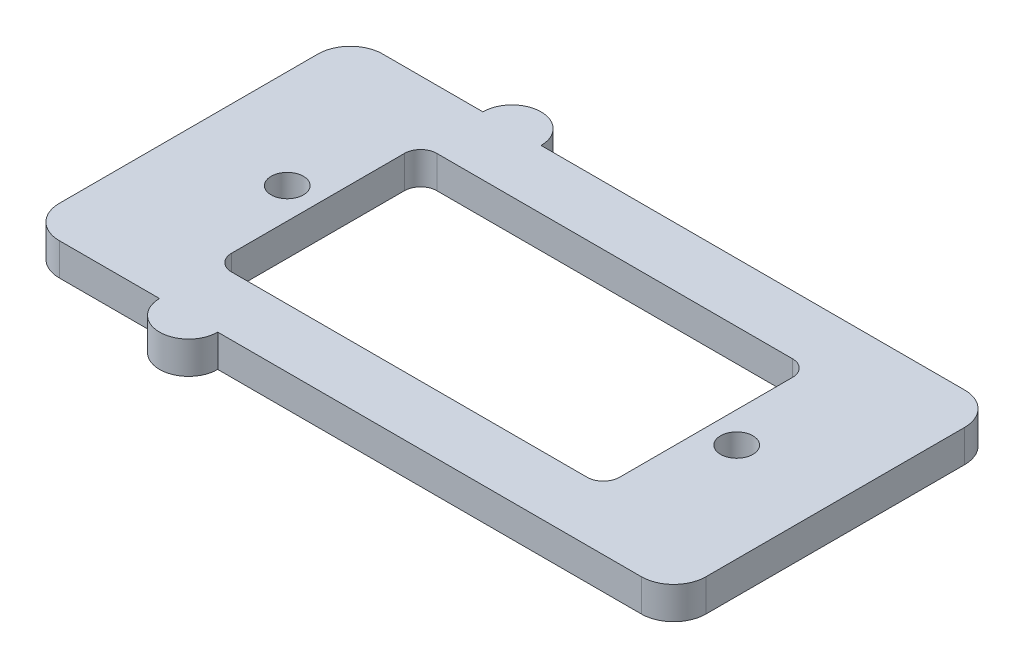
ISO-10303-21;
HEADER;
FILE_DESCRIPTION(('STEP AP214'),'2;1');
FILE_NAME('part.step','',(''),(''),'','','');
FILE_SCHEMA(('AUTOMOTIVE_DESIGN { 1 0 10303 214 1 1 1 1 }'));
ENDSEC;
DATA;
#1=APPLICATION_CONTEXT('core data for automotive mechanical design processes');
#2=APPLICATION_PROTOCOL_DEFINITION('international standard','automotive_design',2000,#1);
#3=PRODUCT_CONTEXT('',#1,'mechanical');
#4=PRODUCT('Part','Part','',(#3));
#5=PRODUCT_RELATED_PRODUCT_CATEGORY('part','',(#4));
#6=PRODUCT_DEFINITION_FORMATION('','',#4);
#7=PRODUCT_DEFINITION_CONTEXT('part definition',#1,'design');
#8=PRODUCT_DEFINITION('design','',#6,#7);
#9=PRODUCT_DEFINITION_SHAPE('','',#8);
#10=(LENGTH_UNIT() NAMED_UNIT(*) SI_UNIT(.MILLI.,.METRE.));
#11=(NAMED_UNIT(*) PLANE_ANGLE_UNIT() SI_UNIT($,.RADIAN.));
#12=(NAMED_UNIT(*) SI_UNIT($,.STERADIAN.) SOLID_ANGLE_UNIT());
#13=UNCERTAINTY_MEASURE_WITH_UNIT(LENGTH_MEASURE(1.E-05),#10,'distance_accuracy_value','');
#14=(GEOMETRIC_REPRESENTATION_CONTEXT(3) GLOBAL_UNCERTAINTY_ASSIGNED_CONTEXT((#13)) GLOBAL_UNIT_ASSIGNED_CONTEXT((#10,
#11,#12)) REPRESENTATION_CONTEXT('',''));
#15=CARTESIAN_POINT('',(0.,0.,0.));
#16=DIRECTION('',(0.,0.,1.));
#17=DIRECTION('',(1.,0.,0.));
#18=AXIS2_PLACEMENT_3D('',#15,#16,#17);
#19=CARTESIAN_POINT('',(-12.,2.,0.));
#20=DIRECTION('',(-1.,0.,0.));
#21=DIRECTION('',(0.,0.,1.));
#22=AXIS2_PLACEMENT_3D('',#19,#20,#21);
#23=PLANE('',#22);
#24=DIRECTION('',(0.,0.,-1.));
#25=VECTOR('',#24,1.);
#26=CARTESIAN_POINT('',(-12.,0.,0.));
#27=LINE('',#26,#25);
#28=CARTESIAN_POINT('',(-12.,0.,5.35));
#29=VERTEX_POINT('',#28);
#30=CARTESIAN_POINT('',(-12.,0.,-5.34999999999998));
#31=VERTEX_POINT('',#30);
#32=EDGE_CURVE('E243',#29,#31,#27,.T.);
#33=ORIENTED_EDGE('',*,*,#32,.T.);
#34=DIRECTION('',(0.,-1.,0.));
#35=VECTOR('',#34,1.);
#36=CARTESIAN_POINT('',(-12.,2.,-5.34999999999998));
#37=LINE('',#36,#35);
#38=CARTESIAN_POINT('',(-12.,2.,-5.34999999999998));
#39=VERTEX_POINT('',#38);
#40=EDGE_CURVE('E11',#39,#31,#37,.T.);
#41=ORIENTED_EDGE('',*,*,#40,.F.);
#42=DIRECTION('',(0.,0.,-1.));
#43=VECTOR('',#42,1.);
#44=CARTESIAN_POINT('',(-12.,2.,0.));
#45=LINE('',#44,#43);
#46=CARTESIAN_POINT('',(-12.,2.,5.35));
#47=VERTEX_POINT('',#46);
#48=EDGE_CURVE('E345',#47,#39,#45,.T.);
#49=ORIENTED_EDGE('',*,*,#48,.F.);
#50=DIRECTION('',(0.,-1.,0.));
#51=VECTOR('',#50,1.);
#52=CARTESIAN_POINT('',(-12.,2.,5.35));
#53=LINE('',#52,#51);
#54=EDGE_CURVE('E261',#47,#29,#53,.T.);
#55=ORIENTED_EDGE('',*,*,#54,.T.);
#56=EDGE_LOOP('',(#33,#41,#49,#55));
#57=FACE_BOUND('',#56,.T.);
#58=ADVANCED_FACE('F35',(#57),#23,.F.);
#59=CARTESIAN_POINT('',(-11.,2.,-5.34999999999999));
#60=DIRECTION('',(0.,-1.,0.));
#61=DIRECTION('',(0.,0.,-1.));
#62=AXIS2_PLACEMENT_3D('',#59,#60,#61);
#63=CYLINDRICAL_SURFACE('',#62,1.);
#64=CARTESIAN_POINT('',(-11.,0.,-5.34999999999999));
#65=DIRECTION('',(0.,1.,0.));
#66=DIRECTION('',(0.,0.,1.));
#67=AXIS2_PLACEMENT_3D('',#64,#65,#66);
#68=CIRCLE('',#67,1.);
#69=CARTESIAN_POINT('',(-11.,0.,-6.34999999999999));
#70=VERTEX_POINT('',#69);
#71=EDGE_CURVE('E246',#31,#70,#68,.F.);
#72=ORIENTED_EDGE('',*,*,#71,.T.);
#73=DIRECTION('',(0.,-1.,0.));
#74=VECTOR('',#73,1.);
#75=CARTESIAN_POINT('',(-11.,2.,-6.34999999999999));
#76=LINE('',#75,#74);
#77=CARTESIAN_POINT('',(-11.,2.,-6.34999999999999));
#78=VERTEX_POINT('',#77);
#79=EDGE_CURVE('E45',#78,#70,#76,.T.);
#80=ORIENTED_EDGE('',*,*,#79,.F.);
#81=CARTESIAN_POINT('',(-11.,2.,-5.34999999999999));
#82=DIRECTION('',(0.,1.,0.));
#83=DIRECTION('',(0.,0.,1.));
#84=AXIS2_PLACEMENT_3D('',#81,#82,#83);
#85=CIRCLE('',#84,1.);
#86=EDGE_CURVE('E347',#39,#78,#85,.F.);
#87=ORIENTED_EDGE('',*,*,#86,.F.);
#88=ORIENTED_EDGE('',*,*,#40,.T.);
#89=EDGE_LOOP('',(#72,#80,#87,#88));
#90=FACE_BOUND('',#89,.T.);
#91=ADVANCED_FACE('F376',(#90),#63,.F.);
#92=CARTESIAN_POINT('',(0.,2.,-6.34999999999999));
#93=DIRECTION('',(0.,0.,-1.));
#94=DIRECTION('',(-1.,0.,0.));
#95=AXIS2_PLACEMENT_3D('',#92,#93,#94);
#96=PLANE('',#95);
#97=DIRECTION('',(1.,0.,0.));
#98=VECTOR('',#97,1.);
#99=CARTESIAN_POINT('',(0.,0.,-6.34999999999999));
#100=LINE('',#99,#98);
#101=CARTESIAN_POINT('',(11.,0.,-6.34999999999999));
#102=VERTEX_POINT('',#101);
#103=EDGE_CURVE('E248',#70,#102,#100,.T.);
#104=ORIENTED_EDGE('',*,*,#103,.T.);
#105=DIRECTION('',(0.,-1.,0.));
#106=VECTOR('',#105,1.);
#107=CARTESIAN_POINT('',(11.,2.,-6.34999999999999));
#108=LINE('',#107,#106);
#109=CARTESIAN_POINT('',(11.,2.,-6.34999999999999));
#110=VERTEX_POINT('',#109);
#111=EDGE_CURVE('E267',#110,#102,#108,.T.);
#112=ORIENTED_EDGE('',*,*,#111,.F.);
#113=DIRECTION('',(1.,0.,0.));
#114=VECTOR('',#113,1.);
#115=CARTESIAN_POINT('',(0.,2.,-6.34999999999999));
#116=LINE('',#115,#114);
#117=EDGE_CURVE('E349',#78,#110,#116,.T.);
#118=ORIENTED_EDGE('',*,*,#117,.F.);
#119=ORIENTED_EDGE('',*,*,#79,.T.);
#120=EDGE_LOOP('',(#104,#112,#118,#119));
#121=FACE_BOUND('',#120,.T.);
#122=ADVANCED_FACE('F381',(#121),#96,.F.);
#123=CARTESIAN_POINT('',(11.,2.,-5.34999999999999));
#124=DIRECTION('',(0.,-1.,0.));
#125=DIRECTION('',(0.,0.,-1.));
#126=AXIS2_PLACEMENT_3D('',#123,#124,#125);
#127=CYLINDRICAL_SURFACE('',#126,1.);
#128=CARTESIAN_POINT('',(11.,0.,-5.34999999999999));
#129=DIRECTION('',(0.,1.,0.));
#130=DIRECTION('',(0.,0.,1.));
#131=AXIS2_PLACEMENT_3D('',#128,#129,#130);
#132=CIRCLE('',#131,1.);
#133=CARTESIAN_POINT('',(12.,0.,-5.34999999999998));
#134=VERTEX_POINT('',#133);
#135=EDGE_CURVE('E250',#102,#134,#132,.F.);
#136=ORIENTED_EDGE('',*,*,#135,.T.);
#137=DIRECTION('',(0.,-1.,0.));
#138=VECTOR('',#137,1.);
#139=CARTESIAN_POINT('',(12.,2.,-5.34999999999998));
#140=LINE('',#139,#138);
#141=CARTESIAN_POINT('',(12.,2.,-5.34999999999998));
#142=VERTEX_POINT('',#141);
#143=EDGE_CURVE('E265',#142,#134,#140,.T.);
#144=ORIENTED_EDGE('',*,*,#143,.F.);
#145=CARTESIAN_POINT('',(11.,2.,-5.34999999999999));
#146=DIRECTION('',(0.,1.,0.));
#147=DIRECTION('',(0.,0.,1.));
#148=AXIS2_PLACEMENT_3D('',#145,#146,#147);
#149=CIRCLE('',#148,1.);
#150=EDGE_CURVE('E351',#110,#142,#149,.F.);
#151=ORIENTED_EDGE('',*,*,#150,.F.);
#152=ORIENTED_EDGE('',*,*,#111,.T.);
#153=EDGE_LOOP('',(#136,#144,#151,#152));
#154=FACE_BOUND('',#153,.T.);
#155=ADVANCED_FACE('F556',(#154),#127,.F.);
#156=CARTESIAN_POINT('',(12.,2.,0.));
#157=DIRECTION('',(-1.,0.,0.));
#158=DIRECTION('',(0.,0.,1.));
#159=AXIS2_PLACEMENT_3D('',#156,#157,#158);
#160=PLANE('',#159);
#161=DIRECTION('',(0.,0.,-1.));
#162=VECTOR('',#161,1.);
#163=CARTESIAN_POINT('',(12.,0.,0.));
#164=LINE('',#163,#162);
#165=CARTESIAN_POINT('',(12.,0.,5.35));
#166=VERTEX_POINT('',#165);
#167=EDGE_CURVE('E253',#166,#134,#164,.T.);
#168=ORIENTED_EDGE('',*,*,#167,.F.);
#169=DIRECTION('',(0.,-1.,0.));
#170=VECTOR('',#169,1.);
#171=CARTESIAN_POINT('',(12.,2.,5.35));
#172=LINE('',#171,#170);
#173=CARTESIAN_POINT('',(12.,2.,5.35));
#174=VERTEX_POINT('',#173);
#175=EDGE_CURVE('E191',#174,#166,#172,.T.);
#176=ORIENTED_EDGE('',*,*,#175,.F.);
#177=DIRECTION('',(0.,0.,-1.));
#178=VECTOR('',#177,1.);
#179=CARTESIAN_POINT('',(12.,2.,0.));
#180=LINE('',#179,#178);
#181=EDGE_CURVE('E197',#174,#142,#180,.T.);
#182=ORIENTED_EDGE('',*,*,#181,.T.);
#183=ORIENTED_EDGE('',*,*,#143,.T.);
#184=EDGE_LOOP('',(#168,#176,#182,#183));
#185=FACE_BOUND('',#184,.T.);
#186=ADVANCED_FACE('F354',(#185),#160,.T.);
#187=CARTESIAN_POINT('',(11.,2.,5.35000000000001));
#188=DIRECTION('',(0.,-1.,0.));
#189=DIRECTION('',(0.,0.,-1.));
#190=AXIS2_PLACEMENT_3D('',#187,#188,#189);
#191=CYLINDRICAL_SURFACE('',#190,1.);
#192=CARTESIAN_POINT('',(11.,0.,5.35000000000001));
#193=DIRECTION('',(0.,1.,0.));
#194=DIRECTION('',(0.,0.,1.));
#195=AXIS2_PLACEMENT_3D('',#192,#193,#194);
#196=CIRCLE('',#195,1.);
#197=CARTESIAN_POINT('',(11.,0.,6.35000000000001));
#198=VERTEX_POINT('',#197);
#199=EDGE_CURVE('E186',#198,#166,#196,.T.);
#200=ORIENTED_EDGE('',*,*,#199,.F.);
#201=DIRECTION('',(0.,-1.,0.));
#202=VECTOR('',#201,1.);
#203=CARTESIAN_POINT('',(11.,2.,6.35000000000001));
#204=LINE('',#203,#202);
#205=CARTESIAN_POINT('',(11.,2.,6.35000000000001));
#206=VERTEX_POINT('',#205);
#207=EDGE_CURVE('E181',#206,#198,#204,.T.);
#208=ORIENTED_EDGE('',*,*,#207,.F.);
#209=CARTESIAN_POINT('',(11.,2.,5.35000000000001));
#210=DIRECTION('',(0.,1.,0.));
#211=DIRECTION('',(0.,0.,1.));
#212=AXIS2_PLACEMENT_3D('',#209,#210,#211);
#213=CIRCLE('',#212,1.);
#214=EDGE_CURVE('E184',#206,#174,#213,.T.);
#215=ORIENTED_EDGE('',*,*,#214,.T.);
#216=ORIENTED_EDGE('',*,*,#175,.T.);
#217=EDGE_LOOP('',(#200,#208,#215,#216));
#218=FACE_BOUND('',#217,.T.);
#219=ADVANCED_FACE('F183',(#218),#191,.F.);
#220=CARTESIAN_POINT('',(0.,2.,6.35000000000001));
#221=DIRECTION('',(0.,0.,-1.));
#222=DIRECTION('',(-1.,0.,0.));
#223=AXIS2_PLACEMENT_3D('',#220,#221,#222);
#224=PLANE('',#223);
#225=DIRECTION('',(1.,0.,0.));
#226=VECTOR('',#225,1.);
#227=CARTESIAN_POINT('',(0.,0.,6.35000000000001));
#228=LINE('',#227,#226);
#229=CARTESIAN_POINT('',(-11.,0.,6.35000000000001));
#230=VERTEX_POINT('',#229);
#231=EDGE_CURVE('E257',#230,#198,#228,.T.);
#232=ORIENTED_EDGE('',*,*,#231,.F.);
#233=DIRECTION('',(0.,-1.,0.));
#234=VECTOR('',#233,1.);
#235=CARTESIAN_POINT('',(-11.,2.,6.35000000000001));
#236=LINE('',#235,#234);
#237=CARTESIAN_POINT('',(-11.,2.,6.35000000000001));
#238=VERTEX_POINT('',#237);
#239=EDGE_CURVE('E118',#238,#230,#236,.T.);
#240=ORIENTED_EDGE('',*,*,#239,.F.);
#241=DIRECTION('',(1.,0.,0.));
#242=VECTOR('',#241,1.);
#243=CARTESIAN_POINT('',(0.,2.,6.35000000000001));
#244=LINE('',#243,#242);
#245=EDGE_CURVE('E195',#238,#206,#244,.T.);
#246=ORIENTED_EDGE('',*,*,#245,.T.);
#247=ORIENTED_EDGE('',*,*,#207,.T.);
#248=EDGE_LOOP('',(#232,#240,#246,#247));
#249=FACE_BOUND('',#248,.T.);
#250=ADVANCED_FACE('F199',(#249),#224,.T.);
#251=CARTESIAN_POINT('',(-18.,2.,-7.99999999999999));
#252=DIRECTION('',(0.,-1.,0.));
#253=DIRECTION('',(0.,0.,-1.));
#254=AXIS2_PLACEMENT_3D('',#251,#252,#253);
#255=CYLINDRICAL_SURFACE('',#254,2.);
#256=CARTESIAN_POINT('',(-18.,0.,-7.99999999999999));
#257=DIRECTION('',(0.,1.,0.));
#258=DIRECTION('',(0.,0.,1.));
#259=AXIS2_PLACEMENT_3D('',#256,#257,#258);
#260=CIRCLE('',#259,2.);
#261=CARTESIAN_POINT('',(-20.,0.,-7.99999999999999));
#262=VERTEX_POINT('',#261);
#263=CARTESIAN_POINT('',(-18.,0.,-9.99999999999999));
#264=VERTEX_POINT('',#263);
#265=EDGE_CURVE('E211',#262,#264,#260,.F.);
#266=ORIENTED_EDGE('',*,*,#265,.F.);
#267=DIRECTION('',(0.,-1.,0.));
#268=VECTOR('',#267,1.);
#269=CARTESIAN_POINT('',(-20.,2.,-7.99999999999999));
#270=LINE('',#269,#268);
#271=CARTESIAN_POINT('',(-20.,2.,-7.99999999999999));
#272=VERTEX_POINT('',#271);
#273=EDGE_CURVE('E39',#272,#262,#270,.T.);
#274=ORIENTED_EDGE('',*,*,#273,.F.);
#275=CARTESIAN_POINT('',(-18.,2.,-7.99999999999999));
#276=DIRECTION('',(0.,1.,0.));
#277=DIRECTION('',(0.,0.,1.));
#278=AXIS2_PLACEMENT_3D('',#275,#276,#277);
#279=CIRCLE('',#278,2.);
#280=CARTESIAN_POINT('',(-18.,2.,-9.99999999999999));
#281=VERTEX_POINT('',#280);
#282=EDGE_CURVE('E326',#272,#281,#279,.F.);
#283=ORIENTED_EDGE('',*,*,#282,.T.);
#284=DIRECTION('',(0.,-1.,0.));
#285=VECTOR('',#284,1.);
#286=CARTESIAN_POINT('',(-18.,2.,-9.99999999999999));
#287=LINE('',#286,#285);
#288=EDGE_CURVE('E201',#281,#264,#287,.T.);
#289=ORIENTED_EDGE('',*,*,#288,.T.);
#290=EDGE_LOOP('',(#266,#274,#283,#289));
#291=FACE_BOUND('',#290,.T.);
#292=ADVANCED_FACE('F304',(#291),#255,.T.);
#293=CARTESIAN_POINT('',(-20.,2.,0.));
#294=DIRECTION('',(-1.,0.,0.));
#295=DIRECTION('',(0.,0.,1.));
#296=AXIS2_PLACEMENT_3D('',#293,#294,#295);
#297=PLANE('',#296);
#298=DIRECTION('',(0.,0.,-1.));
#299=VECTOR('',#298,1.);
#300=CARTESIAN_POINT('',(-20.,0.,0.));
#301=LINE('',#300,#299);
#302=CARTESIAN_POINT('',(-20.,0.,8.00000000000001));
#303=VERTEX_POINT('',#302);
#304=EDGE_CURVE('E214',#303,#262,#301,.T.);
#305=ORIENTED_EDGE('',*,*,#304,.F.);
#306=DIRECTION('',(0.,-1.,0.));
#307=VECTOR('',#306,1.);
#308=CARTESIAN_POINT('',(-20.,2.,8.00000000000001));
#309=LINE('',#308,#307);
#310=CARTESIAN_POINT('',(-20.,2.,8.00000000000001));
#311=VERTEX_POINT('',#310);
#312=EDGE_CURVE('E294',#311,#303,#309,.T.);
#313=ORIENTED_EDGE('',*,*,#312,.F.);
#314=DIRECTION('',(0.,0.,-1.));
#315=VECTOR('',#314,1.);
#316=CARTESIAN_POINT('',(-20.,2.,0.));
#317=LINE('',#316,#315);
#318=EDGE_CURVE('E303',#311,#272,#317,.T.);
#319=ORIENTED_EDGE('',*,*,#318,.T.);
#320=ORIENTED_EDGE('',*,*,#273,.T.);
#321=EDGE_LOOP('',(#305,#313,#319,#320));
#322=FACE_BOUND('',#321,.T.);
#323=ADVANCED_FACE('F301',(#322),#297,.T.);
#324=CARTESIAN_POINT('',(-18.,2.,8.00000000000001));
#325=DIRECTION('',(0.,-1.,0.));
#326=DIRECTION('',(0.,0.,-1.));
#327=AXIS2_PLACEMENT_3D('',#324,#325,#326);
#328=CYLINDRICAL_SURFACE('',#327,2.);
#329=CARTESIAN_POINT('',(-18.,0.,8.00000000000001));
#330=DIRECTION('',(0.,1.,0.));
#331=DIRECTION('',(0.,0.,1.));
#332=AXIS2_PLACEMENT_3D('',#329,#330,#331);
#333=CIRCLE('',#332,2.);
#334=CARTESIAN_POINT('',(-18.,0.,10.));
#335=VERTEX_POINT('',#334);
#336=EDGE_CURVE('E217',#335,#303,#333,.F.);
#337=ORIENTED_EDGE('',*,*,#336,.F.);
#338=DIRECTION('',(0.,-1.,0.));
#339=VECTOR('',#338,1.);
#340=CARTESIAN_POINT('',(-18.,2.,10.));
#341=LINE('',#340,#339);
#342=CARTESIAN_POINT('',(-18.,2.,10.));
#343=VERTEX_POINT('',#342);
#344=EDGE_CURVE('E293',#343,#335,#341,.T.);
#345=ORIENTED_EDGE('',*,*,#344,.F.);
#346=CARTESIAN_POINT('',(-18.,2.,8.00000000000001));
#347=DIRECTION('',(0.,1.,0.));
#348=DIRECTION('',(0.,0.,1.));
#349=AXIS2_PLACEMENT_3D('',#346,#347,#348);
#350=CIRCLE('',#349,2.);
#351=EDGE_CURVE('E314',#343,#311,#350,.F.);
#352=ORIENTED_EDGE('',*,*,#351,.T.);
#353=ORIENTED_EDGE('',*,*,#312,.T.);
#354=EDGE_LOOP('',(#337,#345,#352,#353));
#355=FACE_BOUND('',#354,.T.);
#356=ADVANCED_FACE('F311',(#355),#328,.T.);
#357=CARTESIAN_POINT('',(0.,2.,10.));
#358=DIRECTION('',(0.,0.,-1.));
#359=DIRECTION('',(-1.,0.,0.));
#360=AXIS2_PLACEMENT_3D('',#357,#358,#359);
#361=PLANE('',#360);
#362=DIRECTION('',(1.,0.,0.));
#363=VECTOR('',#362,1.);
#364=CARTESIAN_POINT('',(0.,0.,10.));
#365=LINE('',#364,#363);
#366=CARTESIAN_POINT('',(-11.8,0.,10.));
#367=VERTEX_POINT('',#366);
#368=EDGE_CURVE('E220',#335,#367,#365,.T.);
#369=ORIENTED_EDGE('',*,*,#368,.T.);
#370=DIRECTION('',(0.,-1.,0.));
#371=VECTOR('',#370,1.);
#372=CARTESIAN_POINT('',(-11.8,2.,10.));
#373=LINE('',#372,#371);
#374=CARTESIAN_POINT('',(-11.8,2.,10.));
#375=VERTEX_POINT('',#374);
#376=EDGE_CURVE('E290',#375,#367,#373,.T.);
#377=ORIENTED_EDGE('',*,*,#376,.F.);
#378=DIRECTION('',(1.,0.,0.));
#379=VECTOR('',#378,1.);
#380=CARTESIAN_POINT('',(0.,2.,10.));
#381=LINE('',#380,#379);
#382=EDGE_CURVE('E318',#343,#375,#381,.T.);
#383=ORIENTED_EDGE('',*,*,#382,.F.);
#384=ORIENTED_EDGE('',*,*,#344,.T.);
#385=EDGE_LOOP('',(#369,#377,#383,#384));
#386=FACE_BOUND('',#385,.T.);
#387=ADVANCED_FACE('F319',(#386),#361,.F.);
#388=CARTESIAN_POINT('',(-10.,2.,10.));
#389=DIRECTION('',(0.,-1.,0.));
#390=DIRECTION('',(0.,0.,-1.));
#391=AXIS2_PLACEMENT_3D('',#388,#389,#390);
#392=CYLINDRICAL_SURFACE('',#391,1.8);
#393=CARTESIAN_POINT('',(-10.,0.,10.));
#394=DIRECTION('',(0.,1.,0.));
#395=DIRECTION('',(0.,0.,1.));
#396=AXIS2_PLACEMENT_3D('',#393,#394,#395);
#397=CIRCLE('',#396,1.8);
#398=CARTESIAN_POINT('',(-8.2,0.,10.));
#399=VERTEX_POINT('',#398);
#400=EDGE_CURVE('E223',#367,#399,#397,.T.);
#401=ORIENTED_EDGE('',*,*,#400,.T.);
#402=DIRECTION('',(0.,-1.,0.));
#403=VECTOR('',#402,1.);
#404=CARTESIAN_POINT('',(-8.2,2.,10.));
#405=LINE('',#404,#403);
#406=CARTESIAN_POINT('',(-8.2,2.,10.));
#407=VERTEX_POINT('',#406);
#408=EDGE_CURVE('E287',#407,#399,#405,.T.);
#409=ORIENTED_EDGE('',*,*,#408,.F.);
#410=CARTESIAN_POINT('',(-10.,2.,10.));
#411=DIRECTION('',(0.,1.,0.));
#412=DIRECTION('',(0.,0.,1.));
#413=AXIS2_PLACEMENT_3D('',#410,#411,#412);
#414=CIRCLE('',#413,1.8);
#415=EDGE_CURVE('E322',#375,#407,#414,.T.);
#416=ORIENTED_EDGE('',*,*,#415,.F.);
#417=ORIENTED_EDGE('',*,*,#376,.T.);
#418=EDGE_LOOP('',(#401,#409,#416,#417));
#419=FACE_BOUND('',#418,.T.);
#420=ADVANCED_FACE('F410',(#419),#392,.T.);
#421=CARTESIAN_POINT('',(18.,0.,10.));
#422=VERTEX_POINT('',#421);
#423=EDGE_CURVE('E224',#399,#422,#365,.T.);
#424=ORIENTED_EDGE('',*,*,#423,.T.);
#425=DIRECTION('',(0.,-1.,0.));
#426=VECTOR('',#425,1.);
#427=CARTESIAN_POINT('',(18.,2.,10.));
#428=LINE('',#427,#426);
#429=CARTESIAN_POINT('',(18.,2.,10.));
#430=VERTEX_POINT('',#429);
#431=EDGE_CURVE('E284',#430,#422,#428,.T.);
#432=ORIENTED_EDGE('',*,*,#431,.F.);
#433=EDGE_CURVE('E324',#407,#430,#381,.T.);
#434=ORIENTED_EDGE('',*,*,#433,.F.);
#435=ORIENTED_EDGE('',*,*,#408,.T.);
#436=EDGE_LOOP('',(#424,#432,#434,#435));
#437=FACE_BOUND('',#436,.T.);
#438=ADVANCED_FACE('F406',(#437),#361,.F.);
#439=CARTESIAN_POINT('',(18.,2.,8.00000000000001));
#440=DIRECTION('',(0.,-1.,0.));
#441=DIRECTION('',(0.,0.,-1.));
#442=AXIS2_PLACEMENT_3D('',#439,#440,#441);
#443=CYLINDRICAL_SURFACE('',#442,2.);
#444=CARTESIAN_POINT('',(18.,0.,8.00000000000001));
#445=DIRECTION('',(0.,1.,0.));
#446=DIRECTION('',(0.,0.,1.));
#447=AXIS2_PLACEMENT_3D('',#444,#445,#446);
#448=CIRCLE('',#447,2.);
#449=CARTESIAN_POINT('',(20.,0.,8.00000000000001));
#450=VERTEX_POINT('',#449);
#451=EDGE_CURVE('E227',#422,#450,#448,.T.);
#452=ORIENTED_EDGE('',*,*,#451,.T.);
#453=DIRECTION('',(0.,-1.,0.));
#454=VECTOR('',#453,1.);
#455=CARTESIAN_POINT('',(20.,2.,8.00000000000001));
#456=LINE('',#455,#454);
#457=CARTESIAN_POINT('',(20.,2.,8.00000000000001));
#458=VERTEX_POINT('',#457);
#459=EDGE_CURVE('E281',#458,#450,#456,.T.);
#460=ORIENTED_EDGE('',*,*,#459,.F.);
#461=CARTESIAN_POINT('',(18.,2.,8.00000000000001));
#462=DIRECTION('',(0.,1.,0.));
#463=DIRECTION('',(0.,0.,1.));
#464=AXIS2_PLACEMENT_3D('',#461,#462,#463);
#465=CIRCLE('',#464,2.);
#466=EDGE_CURVE('E331',#430,#458,#465,.T.);
#467=ORIENTED_EDGE('',*,*,#466,.F.);
#468=ORIENTED_EDGE('',*,*,#431,.T.);
#469=EDGE_LOOP('',(#452,#460,#467,#468));
#470=FACE_BOUND('',#469,.T.);
#471=ADVANCED_FACE('F402',(#470),#443,.T.);
#472=CARTESIAN_POINT('',(20.,2.,0.));
#473=DIRECTION('',(-1.,0.,0.));
#474=DIRECTION('',(0.,0.,1.));
#475=AXIS2_PLACEMENT_3D('',#472,#473,#474);
#476=PLANE('',#475);
#477=DIRECTION('',(0.,0.,-1.));
#478=VECTOR('',#477,1.);
#479=CARTESIAN_POINT('',(20.,0.,0.));
#480=LINE('',#479,#478);
#481=CARTESIAN_POINT('',(20.,0.,-7.99999999999999));
#482=VERTEX_POINT('',#481);
#483=EDGE_CURVE('E230',#450,#482,#480,.T.);
#484=ORIENTED_EDGE('',*,*,#483,.T.);
#485=DIRECTION('',(0.,-1.,0.));
#486=VECTOR('',#485,1.);
#487=CARTESIAN_POINT('',(20.,2.,-7.99999999999999));
#488=LINE('',#487,#486);
#489=CARTESIAN_POINT('',(20.,2.,-7.99999999999999));
#490=VERTEX_POINT('',#489);
#491=EDGE_CURVE('E279',#490,#482,#488,.T.);
#492=ORIENTED_EDGE('',*,*,#491,.F.);
#493=DIRECTION('',(0.,0.,-1.));
#494=VECTOR('',#493,1.);
#495=CARTESIAN_POINT('',(20.,2.,0.));
#496=LINE('',#495,#494);
#497=EDGE_CURVE('E334',#458,#490,#496,.T.);
#498=ORIENTED_EDGE('',*,*,#497,.F.);
#499=ORIENTED_EDGE('',*,*,#459,.T.);
#500=EDGE_LOOP('',(#484,#492,#498,#499));
#501=FACE_BOUND('',#500,.T.);
#502=ADVANCED_FACE('F398',(#501),#476,.F.);
#503=CARTESIAN_POINT('',(18.,2.,-7.99999999999999));
#504=DIRECTION('',(0.,-1.,0.));
#505=DIRECTION('',(0.,0.,-1.));
#506=AXIS2_PLACEMENT_3D('',#503,#504,#505);
#507=CYLINDRICAL_SURFACE('',#506,2.);
#508=CARTESIAN_POINT('',(18.,0.,-7.99999999999999));
#509=DIRECTION('',(0.,1.,0.));
#510=DIRECTION('',(0.,0.,1.));
#511=AXIS2_PLACEMENT_3D('',#508,#509,#510);
#512=CIRCLE('',#511,2.);
#513=CARTESIAN_POINT('',(18.,0.,-9.99999999999999));
#514=VERTEX_POINT('',#513);
#515=EDGE_CURVE('E233',#514,#482,#512,.F.);
#516=ORIENTED_EDGE('',*,*,#515,.F.);
#517=DIRECTION('',(0.,-1.,0.));
#518=VECTOR('',#517,1.);
#519=CARTESIAN_POINT('',(18.,2.,-9.99999999999999));
#520=LINE('',#519,#518);
#521=CARTESIAN_POINT('',(18.,2.,-9.99999999999999));
#522=VERTEX_POINT('',#521);
#523=EDGE_CURVE('E277',#522,#514,#520,.T.);
#524=ORIENTED_EDGE('',*,*,#523,.F.);
#525=CARTESIAN_POINT('',(18.,2.,-7.99999999999999));
#526=DIRECTION('',(0.,1.,0.));
#527=DIRECTION('',(0.,0.,1.));
#528=AXIS2_PLACEMENT_3D('',#525,#526,#527);
#529=CIRCLE('',#528,2.);
#530=EDGE_CURVE('E336',#522,#490,#529,.F.);
#531=ORIENTED_EDGE('',*,*,#530,.T.);
#532=ORIENTED_EDGE('',*,*,#491,.T.);
#533=EDGE_LOOP('',(#516,#524,#531,#532));
#534=FACE_BOUND('',#533,.T.);
#535=ADVANCED_FACE('F395',(#534),#507,.T.);
#536=CARTESIAN_POINT('',(0.,2.,-9.99999999999999));
#537=DIRECTION('',(0.,0.,-1.));
#538=DIRECTION('',(-1.,0.,0.));
#539=AXIS2_PLACEMENT_3D('',#536,#537,#538);
#540=PLANE('',#539);
#541=DIRECTION('',(1.,0.,0.));
#542=VECTOR('',#541,1.);
#543=CARTESIAN_POINT('',(0.,0.,-9.99999999999999));
#544=LINE('',#543,#542);
#545=CARTESIAN_POINT('',(-8.2,0.,-9.99999999999999));
#546=VERTEX_POINT('',#545);
#547=EDGE_CURVE('E236',#546,#514,#544,.T.);
#548=ORIENTED_EDGE('',*,*,#547,.F.);
#549=DIRECTION('',(0.,-1.,0.));
#550=VECTOR('',#549,1.);
#551=CARTESIAN_POINT('',(-8.2,2.,-9.99999999999999));
#552=LINE('',#551,#550);
#553=CARTESIAN_POINT('',(-8.2,2.,-9.99999999999999));
#554=VERTEX_POINT('',#553);
#555=EDGE_CURVE('E275',#554,#546,#552,.T.);
#556=ORIENTED_EDGE('',*,*,#555,.F.);
#557=DIRECTION('',(1.,0.,0.));
#558=VECTOR('',#557,1.);
#559=CARTESIAN_POINT('',(0.,2.,-9.99999999999999));
#560=LINE('',#559,#558);
#561=EDGE_CURVE('E339',#554,#522,#560,.T.);
#562=ORIENTED_EDGE('',*,*,#561,.T.);
#563=ORIENTED_EDGE('',*,*,#523,.T.);
#564=EDGE_LOOP('',(#548,#556,#562,#563));
#565=FACE_BOUND('',#564,.T.);
#566=ADVANCED_FACE('F391',(#565),#540,.T.);
#567=CARTESIAN_POINT('',(-10.,2.,-9.99999999999999));
#568=DIRECTION('',(0.,-1.,0.));
#569=DIRECTION('',(0.,0.,-1.));
#570=AXIS2_PLACEMENT_3D('',#567,#568,#569);
#571=CYLINDRICAL_SURFACE('',#570,1.8);
#572=CARTESIAN_POINT('',(-10.,0.,-9.99999999999999));
#573=DIRECTION('',(0.,1.,0.));
#574=DIRECTION('',(0.,0.,1.));
#575=AXIS2_PLACEMENT_3D('',#572,#573,#574);
#576=CIRCLE('',#575,1.8);
#577=CARTESIAN_POINT('',(-11.8,0.,-9.99999999999999));
#578=VERTEX_POINT('',#577);
#579=EDGE_CURVE('E239',#546,#578,#576,.T.);
#580=ORIENTED_EDGE('',*,*,#579,.T.);
#581=DIRECTION('',(0.,-1.,0.));
#582=VECTOR('',#581,1.);
#583=CARTESIAN_POINT('',(-11.8,2.,-9.99999999999999));
#584=LINE('',#583,#582);
#585=CARTESIAN_POINT('',(-11.8,2.,-9.99999999999999));
#586=VERTEX_POINT('',#585);
#587=EDGE_CURVE('E273',#586,#578,#584,.T.);
#588=ORIENTED_EDGE('',*,*,#587,.F.);
#589=CARTESIAN_POINT('',(-10.,2.,-9.99999999999999));
#590=DIRECTION('',(0.,1.,0.));
#591=DIRECTION('',(0.,0.,1.));
#592=AXIS2_PLACEMENT_3D('',#589,#590,#591);
#593=CIRCLE('',#592,1.8);
#594=EDGE_CURVE('E342',#554,#586,#593,.T.);
#595=ORIENTED_EDGE('',*,*,#594,.F.);
#596=ORIENTED_EDGE('',*,*,#555,.T.);
#597=EDGE_LOOP('',(#580,#588,#595,#596));
#598=FACE_BOUND('',#597,.T.);
#599=ADVANCED_FACE('F389',(#598),#571,.T.);
#600=EDGE_CURVE('E240',#264,#578,#544,.T.);
#601=ORIENTED_EDGE('',*,*,#600,.F.);
#602=ORIENTED_EDGE('',*,*,#288,.F.);
#603=EDGE_CURVE('E343',#281,#586,#560,.T.);
#604=ORIENTED_EDGE('',*,*,#603,.T.);
#605=ORIENTED_EDGE('',*,*,#587,.T.);
#606=EDGE_LOOP('',(#601,#602,#604,#605));
#607=FACE_BOUND('',#606,.T.);
#608=ADVANCED_FACE('F386',(#607),#540,.T.);
#609=CARTESIAN_POINT('',(13.9,2.,0.));
#610=DIRECTION('',(0.,-1.,0.));
#611=DIRECTION('',(0.,0.,-1.));
#612=AXIS2_PLACEMENT_3D('',#609,#610,#611);
#613=CYLINDRICAL_SURFACE('',#612,1.);
#614=CARTESIAN_POINT('',(13.9,2.,0.));
#615=DIRECTION('',(0.,1.,0.));
#616=DIRECTION('',(0.,0.,1.));
#617=AXIS2_PLACEMENT_3D('',#614,#615,#616);
#618=CIRCLE('',#617,1.);
#619=CARTESIAN_POINT('',(13.9,2.,1.));
#620=VERTEX_POINT('',#619);
#621=EDGE_CURVE('E427',#620,#620,#618,.T.);
#622=ORIENTED_EDGE('',*,*,#621,.T.);
#623=EDGE_LOOP('',(#622));
#624=FACE_BOUND('',#623,.T.);
#625=CARTESIAN_POINT('',(13.9,0.,0.));
#626=DIRECTION('',(0.,1.,0.));
#627=DIRECTION('',(0.,0.,1.));
#628=AXIS2_PLACEMENT_3D('',#625,#626,#627);
#629=CIRCLE('',#628,1.);
#630=CARTESIAN_POINT('',(13.9,0.,1.));
#631=VERTEX_POINT('',#630);
#632=EDGE_CURVE('E208',#631,#631,#629,.T.);
#633=ORIENTED_EDGE('',*,*,#632,.F.);
#634=EDGE_LOOP('',(#633));
#635=FACE_BOUND('',#634,.T.);
#636=ADVANCED_FACE('F371',(#624,#635),#613,.F.);
#637=CARTESIAN_POINT('',(-13.9,2.,0.));
#638=DIRECTION('',(0.,-1.,0.));
#639=DIRECTION('',(0.,0.,-1.));
#640=AXIS2_PLACEMENT_3D('',#637,#638,#639);
#641=CYLINDRICAL_SURFACE('',#640,1.);
#642=CARTESIAN_POINT('',(-13.9,2.,0.));
#643=DIRECTION('',(0.,1.,0.));
#644=DIRECTION('',(0.,0.,1.));
#645=AXIS2_PLACEMENT_3D('',#642,#643,#644);
#646=CIRCLE('',#645,1.);
#647=CARTESIAN_POINT('',(-13.9,2.,1.00000000000001));
#648=VERTEX_POINT('',#647);
#649=EDGE_CURVE('E260',#648,#648,#646,.T.);
#650=ORIENTED_EDGE('',*,*,#649,.T.);
#651=EDGE_LOOP('',(#650));
#652=FACE_BOUND('',#651,.T.);
#653=CARTESIAN_POINT('',(-13.9,0.,0.));
#654=DIRECTION('',(0.,1.,0.));
#655=DIRECTION('',(0.,0.,1.));
#656=AXIS2_PLACEMENT_3D('',#653,#654,#655);
#657=CIRCLE('',#656,1.);
#658=CARTESIAN_POINT('',(-13.9,0.,1.00000000000001));
#659=VERTEX_POINT('',#658);
#660=EDGE_CURVE('E205',#659,#659,#657,.T.);
#661=ORIENTED_EDGE('',*,*,#660,.F.);
#662=EDGE_LOOP('',(#661));
#663=FACE_BOUND('',#662,.T.);
#664=ADVANCED_FACE('F37',(#652,#663),#641,.F.);
#665=CARTESIAN_POINT('',(-11.,2.,5.35000000000001));
#666=DIRECTION('',(0.,-1.,0.));
#667=DIRECTION('',(0.,0.,-1.));
#668=AXIS2_PLACEMENT_3D('',#665,#666,#667);
#669=CYLINDRICAL_SURFACE('',#668,1.);
#670=CARTESIAN_POINT('',(-11.,0.,5.35000000000001));
#671=DIRECTION('',(0.,1.,0.));
#672=DIRECTION('',(0.,0.,1.));
#673=AXIS2_PLACEMENT_3D('',#670,#671,#672);
#674=CIRCLE('',#673,1.);
#675=EDGE_CURVE('E121',#230,#29,#674,.F.);
#676=ORIENTED_EDGE('',*,*,#675,.T.);
#677=ORIENTED_EDGE('',*,*,#54,.F.);
#678=CARTESIAN_POINT('',(-11.,2.,5.35000000000001));
#679=DIRECTION('',(0.,1.,0.));
#680=DIRECTION('',(0.,0.,1.));
#681=AXIS2_PLACEMENT_3D('',#678,#679,#680);
#682=CIRCLE('',#681,1.);
#683=EDGE_CURVE('E54',#238,#47,#682,.F.);
#684=ORIENTED_EDGE('',*,*,#683,.F.);
#685=ORIENTED_EDGE('',*,*,#239,.T.);
#686=EDGE_LOOP('',(#676,#677,#684,#685));
#687=FACE_BOUND('',#686,.T.);
#688=ADVANCED_FACE('F362',(#687),#669,.F.);
#689=CARTESIAN_POINT('',(0.,2.,0.));
#690=DIRECTION('',(0.,1.,0.));
#691=DIRECTION('',(0.,0.,1.));
#692=AXIS2_PLACEMENT_3D('',#689,#690,#691);
#693=PLANE('',#692);
#694=ORIENTED_EDGE('',*,*,#649,.F.);
#695=EDGE_LOOP('',(#694));
#696=FACE_BOUND('',#695,.T.);
#697=ORIENTED_EDGE('',*,*,#621,.F.);
#698=EDGE_LOOP('',(#697));
#699=FACE_BOUND('',#698,.T.);
#700=ORIENTED_EDGE('',*,*,#282,.F.);
#701=ORIENTED_EDGE('',*,*,#318,.F.);
#702=ORIENTED_EDGE('',*,*,#351,.F.);
#703=ORIENTED_EDGE('',*,*,#382,.T.);
#704=ORIENTED_EDGE('',*,*,#415,.T.);
#705=ORIENTED_EDGE('',*,*,#433,.T.);
#706=ORIENTED_EDGE('',*,*,#466,.T.);
#707=ORIENTED_EDGE('',*,*,#497,.T.);
#708=ORIENTED_EDGE('',*,*,#530,.F.);
#709=ORIENTED_EDGE('',*,*,#561,.F.);
#710=ORIENTED_EDGE('',*,*,#594,.T.);
#711=ORIENTED_EDGE('',*,*,#603,.F.);
#712=EDGE_LOOP('',(#700,#701,#702,#703,#704,#705,#706,#707,#708,#709,#710,#711));
#713=FACE_BOUND('',#712,.T.);
#714=ORIENTED_EDGE('',*,*,#48,.T.);
#715=ORIENTED_EDGE('',*,*,#86,.T.);
#716=ORIENTED_EDGE('',*,*,#117,.T.);
#717=ORIENTED_EDGE('',*,*,#150,.T.);
#718=ORIENTED_EDGE('',*,*,#181,.F.);
#719=ORIENTED_EDGE('',*,*,#214,.F.);
#720=ORIENTED_EDGE('',*,*,#245,.F.);
#721=ORIENTED_EDGE('',*,*,#683,.T.);
#722=EDGE_LOOP('',(#714,#715,#716,#717,#718,#719,#720,#721));
#723=FACE_BOUND('',#722,.T.);
#724=ADVANCED_FACE('F194',(#696,#699,#713,#723),#693,.T.);
#725=CARTESIAN_POINT('',(0.,0.,0.));
#726=DIRECTION('',(0.,1.,0.));
#727=DIRECTION('',(0.,0.,1.));
#728=AXIS2_PLACEMENT_3D('',#725,#726,#727);
#729=PLANE('',#728);
#730=ORIENTED_EDGE('',*,*,#660,.T.);
#731=EDGE_LOOP('',(#730));
#732=FACE_BOUND('',#731,.T.);
#733=ORIENTED_EDGE('',*,*,#632,.T.);
#734=EDGE_LOOP('',(#733));
#735=FACE_BOUND('',#734,.T.);
#736=ORIENTED_EDGE('',*,*,#265,.T.);
#737=ORIENTED_EDGE('',*,*,#600,.T.);
#738=ORIENTED_EDGE('',*,*,#579,.F.);
#739=ORIENTED_EDGE('',*,*,#547,.T.);
#740=ORIENTED_EDGE('',*,*,#515,.T.);
#741=ORIENTED_EDGE('',*,*,#483,.F.);
#742=ORIENTED_EDGE('',*,*,#451,.F.);
#743=ORIENTED_EDGE('',*,*,#423,.F.);
#744=ORIENTED_EDGE('',*,*,#400,.F.);
#745=ORIENTED_EDGE('',*,*,#368,.F.);
#746=ORIENTED_EDGE('',*,*,#336,.T.);
#747=ORIENTED_EDGE('',*,*,#304,.T.);
#748=EDGE_LOOP('',(#736,#737,#738,#739,#740,#741,#742,#743,#744,#745,#746,#747));
#749=FACE_BOUND('',#748,.T.);
#750=ORIENTED_EDGE('',*,*,#32,.F.);
#751=ORIENTED_EDGE('',*,*,#675,.F.);
#752=ORIENTED_EDGE('',*,*,#231,.T.);
#753=ORIENTED_EDGE('',*,*,#199,.T.);
#754=ORIENTED_EDGE('',*,*,#167,.T.);
#755=ORIENTED_EDGE('',*,*,#135,.F.);
#756=ORIENTED_EDGE('',*,*,#103,.F.);
#757=ORIENTED_EDGE('',*,*,#71,.F.);
#758=EDGE_LOOP('',(#750,#751,#752,#753,#754,#755,#756,#757));
#759=FACE_BOUND('',#758,.T.);
#760=ADVANCED_FACE('F308',(#732,#735,#749,#759),#729,.F.);
#761=CLOSED_SHELL('',(#58,#91,#122,#155,#186,#219,#250,#292,#323,#356,#387,#420,#438,#471,#502,
#535,#566,#599,#608,#636,#664,#688,#724,#760));
#762=MANIFOLD_SOLID_BREP('B2',#761);
#763=ADVANCED_BREP_SHAPE_REPRESENTATION('',(#18,#762),#14);
#764=SHAPE_DEFINITION_REPRESENTATION(#9,#763);
ENDSEC;
END-ISO-10303-21;
